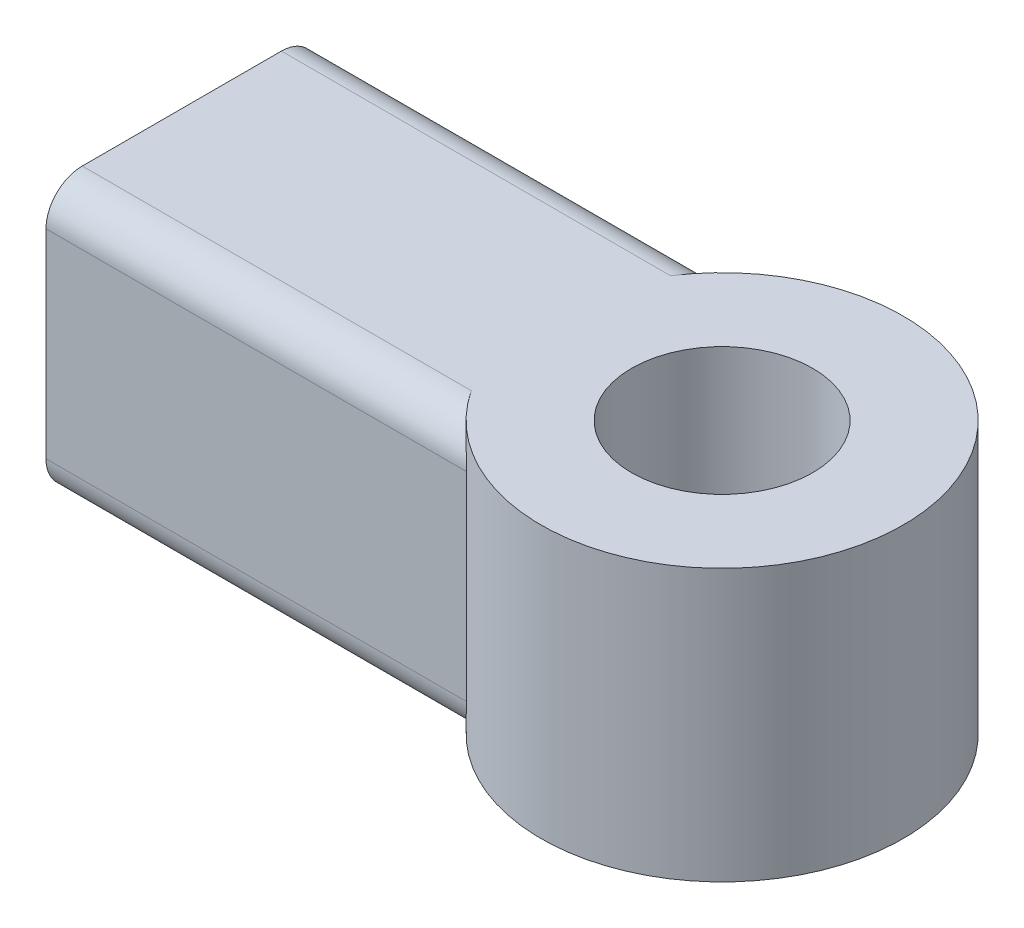
ISO-10303-21;
HEADER;
FILE_DESCRIPTION(('STEP AP214'),'2;1');
FILE_NAME('part.step','',(''),(''),'','','');
FILE_SCHEMA(('AUTOMOTIVE_DESIGN { 1 0 10303 214 1 1 1 1 }'));
ENDSEC;
DATA;
#1=APPLICATION_CONTEXT('core data for automotive mechanical design processes');
#2=APPLICATION_PROTOCOL_DEFINITION('international standard','automotive_design',2000,#1);
#3=PRODUCT_CONTEXT('',#1,'mechanical');
#4=PRODUCT('Part','Part','',(#3));
#5=PRODUCT_RELATED_PRODUCT_CATEGORY('part','',(#4));
#6=PRODUCT_DEFINITION_FORMATION('','',#4);
#7=PRODUCT_DEFINITION_CONTEXT('part definition',#1,'design');
#8=PRODUCT_DEFINITION('design','',#6,#7);
#9=PRODUCT_DEFINITION_SHAPE('','',#8);
#10=(LENGTH_UNIT() NAMED_UNIT(*) SI_UNIT(.MILLI.,.METRE.));
#11=(NAMED_UNIT(*) PLANE_ANGLE_UNIT() SI_UNIT($,.RADIAN.));
#12=(NAMED_UNIT(*) SI_UNIT($,.STERADIAN.) SOLID_ANGLE_UNIT());
#13=UNCERTAINTY_MEASURE_WITH_UNIT(LENGTH_MEASURE(1.E-05),#10,'distance_accuracy_value','');
#14=(GEOMETRIC_REPRESENTATION_CONTEXT(3) GLOBAL_UNCERTAINTY_ASSIGNED_CONTEXT((#13)) GLOBAL_UNIT_ASSIGNED_CONTEXT((#10,
#11,#12)) REPRESENTATION_CONTEXT('',''));
#15=CARTESIAN_POINT('',(0.,0.,0.));
#16=DIRECTION('',(0.,0.,1.));
#17=DIRECTION('',(1.,0.,0.));
#18=AXIS2_PLACEMENT_3D('',#15,#16,#17);
#19=CARTESIAN_POINT('',(0.,9.525,0.));
#20=DIRECTION('',(0.,1.,0.));
#21=DIRECTION('',(0.,0.,1.));
#22=AXIS2_PLACEMENT_3D('',#19,#20,#21);
#23=PLANE('',#22);
#24=CARTESIAN_POINT('',(0.,9.525,0.));
#25=DIRECTION('',(0.,1.,0.));
#26=DIRECTION('',(0.,0.,1.));
#27=AXIS2_PLACEMENT_3D('',#24,#25,#26);
#28=CIRCLE('',#27,6.35);
#29=CARTESIAN_POINT('',(-5.30329555559559,9.525,3.4925));
#30=VERTEX_POINT('',#29);
#31=CARTESIAN_POINT('',(-5.3032955555956,9.525,-3.4925));
#32=VERTEX_POINT('',#31);
#33=EDGE_CURVE('E121',#30,#32,#28,.T.);
#34=ORIENTED_EDGE('',*,*,#33,.T.);
#35=DIRECTION('',(-1.,0.,0.));
#36=VECTOR('',#35,1.);
#37=CARTESIAN_POINT('',(-18.9484589168103,9.525,-3.4925));
#38=LINE('',#37,#36);
#39=CARTESIAN_POINT('',(-18.9484589168103,9.525,-3.49249999999999));
#40=VERTEX_POINT('',#39);
#41=EDGE_CURVE('E106',#32,#40,#38,.T.);
#42=ORIENTED_EDGE('',*,*,#41,.T.);
#43=DIRECTION('',(0.,0.,1.));
#44=VECTOR('',#43,1.);
#45=CARTESIAN_POINT('',(-18.9484589168103,9.525,4.7625));
#46=LINE('',#45,#44);
#47=CARTESIAN_POINT('',(-18.9484589168103,9.525,3.4925));
#48=VERTEX_POINT('',#47);
#49=EDGE_CURVE('E119',#40,#48,#46,.T.);
#50=ORIENTED_EDGE('',*,*,#49,.T.);
#51=DIRECTION('',(1.,0.,0.));
#52=VECTOR('',#51,1.);
#53=CARTESIAN_POINT('',(-4.20013020631504,9.525,3.4925));
#54=LINE('',#53,#52);
#55=EDGE_CURVE('E124',#48,#30,#54,.T.);
#56=ORIENTED_EDGE('',*,*,#55,.T.);
#57=EDGE_LOOP('',(#34,#42,#50,#56));
#58=FACE_BOUND('',#57,.T.);
#59=CARTESIAN_POINT('',(0.,9.525,0.));
#60=DIRECTION('',(0.,1.,0.));
#61=DIRECTION('',(0.,0.,1.));
#62=AXIS2_PLACEMENT_3D('',#59,#60,#61);
#63=CIRCLE('',#62,3.175);
#64=CARTESIAN_POINT('',(0.,9.525,3.175));
#65=VERTEX_POINT('',#64);
#66=EDGE_CURVE('E140',#65,#65,#63,.T.);
#67=ORIENTED_EDGE('',*,*,#66,.F.);
#68=EDGE_LOOP('',(#67));
#69=FACE_BOUND('',#68,.T.);
#70=ADVANCED_FACE('F32',(#58,#69),#23,.T.);
#71=CARTESIAN_POINT('',(0.,0.,0.));
#72=DIRECTION('',(0.,1.,0.));
#73=DIRECTION('',(0.,0.,1.));
#74=AXIS2_PLACEMENT_3D('',#71,#72,#73);
#75=PLANE('',#74);
#76=DIRECTION('',(0.,0.,1.));
#77=VECTOR('',#76,1.);
#78=CARTESIAN_POINT('',(-18.9484589168103,0.,4.7625));
#79=LINE('',#78,#77);
#80=CARTESIAN_POINT('',(-18.9484589168103,0.,-3.49249999999999));
#81=VERTEX_POINT('',#80);
#82=CARTESIAN_POINT('',(-18.9484589168103,0.,3.4925));
#83=VERTEX_POINT('',#82);
#84=EDGE_CURVE('E133',#81,#83,#79,.T.);
#85=ORIENTED_EDGE('',*,*,#84,.F.);
#86=DIRECTION('',(-1.,0.,0.));
#87=VECTOR('',#86,1.);
#88=CARTESIAN_POINT('',(0.,0.,-3.4925));
#89=LINE('',#88,#87);
#90=CARTESIAN_POINT('',(-5.3032955555956,0.,-3.4925));
#91=VERTEX_POINT('',#90);
#92=EDGE_CURVE('E161',#81,#91,#89,.F.);
#93=ORIENTED_EDGE('',*,*,#92,.T.);
#94=CARTESIAN_POINT('',(0.,0.,0.));
#95=DIRECTION('',(0.,1.,0.));
#96=DIRECTION('',(0.,0.,1.));
#97=AXIS2_PLACEMENT_3D('',#94,#95,#96);
#98=CIRCLE('',#97,6.35);
#99=CARTESIAN_POINT('',(-5.30329555559559,0.,3.4925));
#100=VERTEX_POINT('',#99);
#101=EDGE_CURVE('E129',#100,#91,#98,.T.);
#102=ORIENTED_EDGE('',*,*,#101,.F.);
#103=DIRECTION('',(1.,0.,0.));
#104=VECTOR('',#103,1.);
#105=CARTESIAN_POINT('',(0.,0.,3.4925));
#106=LINE('',#105,#104);
#107=EDGE_CURVE('E159',#100,#83,#106,.F.);
#108=ORIENTED_EDGE('',*,*,#107,.T.);
#109=EDGE_LOOP('',(#85,#93,#102,#108));
#110=FACE_BOUND('',#109,.T.);
#111=CARTESIAN_POINT('',(0.,0.,0.));
#112=DIRECTION('',(0.,1.,0.));
#113=DIRECTION('',(0.,0.,1.));
#114=AXIS2_PLACEMENT_3D('',#111,#112,#113);
#115=CIRCLE('',#114,3.175);
#116=CARTESIAN_POINT('',(0.,0.,3.175));
#117=VERTEX_POINT('',#116);
#118=EDGE_CURVE('E136',#117,#117,#115,.T.);
#119=ORIENTED_EDGE('',*,*,#118,.T.);
#120=EDGE_LOOP('',(#119));
#121=FACE_BOUND('',#120,.T.);
#122=ADVANCED_FACE('F206',(#110,#121),#75,.F.);
#123=CARTESIAN_POINT('',(-18.9484589168103,9.525,4.7625));
#124=DIRECTION('',(1.,0.,0.));
#125=DIRECTION('',(0.,0.,-1.));
#126=AXIS2_PLACEMENT_3D('',#123,#124,#125);
#127=PLANE('',#126);
#128=CARTESIAN_POINT('',(-18.9484589168103,4.7625,0.));
#129=DIRECTION('',(-1.,0.,0.));
#130=DIRECTION('',(0.,0.,1.));
#131=AXIS2_PLACEMENT_3D('',#128,#129,#130);
#132=CIRCLE('',#131,3.175);
#133=CARTESIAN_POINT('',(-18.9484589168103,4.7625,3.175));
#134=VERTEX_POINT('',#133);
#135=EDGE_CURVE('E244',#134,#134,#132,.T.);
#136=ORIENTED_EDGE('',*,*,#135,.F.);
#137=EDGE_LOOP('',(#136));
#138=FACE_BOUND('',#137,.T.);
#139=ORIENTED_EDGE('',*,*,#49,.F.);
#140=CARTESIAN_POINT('',(-18.9484589168103,8.255,-3.4925));
#141=DIRECTION('',(1.,0.,0.));
#142=DIRECTION('',(0.,0.,-1.));
#143=AXIS2_PLACEMENT_3D('',#140,#141,#142);
#144=CIRCLE('',#143,1.27);
#145=CARTESIAN_POINT('',(-18.9484589168103,8.255,-4.7625));
#146=VERTEX_POINT('',#145);
#147=EDGE_CURVE('E102',#40,#146,#144,.F.);
#148=ORIENTED_EDGE('',*,*,#147,.T.);
#149=DIRECTION('',(0.,-1.,0.));
#150=VECTOR('',#149,1.);
#151=CARTESIAN_POINT('',(-18.9484589168103,9.525,-4.7625));
#152=LINE('',#151,#150);
#153=CARTESIAN_POINT('',(-18.9484589168103,1.27,-4.7625));
#154=VERTEX_POINT('',#153);
#155=EDGE_CURVE('E131',#146,#154,#152,.T.);
#156=ORIENTED_EDGE('',*,*,#155,.T.);
#157=CARTESIAN_POINT('',(-18.9484589168103,1.27,-3.4925));
#158=DIRECTION('',(1.,0.,0.));
#159=DIRECTION('',(0.,0.,-1.));
#160=AXIS2_PLACEMENT_3D('',#157,#158,#159);
#161=CIRCLE('',#160,1.27);
#162=EDGE_CURVE('E113',#154,#81,#161,.F.);
#163=ORIENTED_EDGE('',*,*,#162,.T.);
#164=ORIENTED_EDGE('',*,*,#84,.T.);
#165=CARTESIAN_POINT('',(-18.9484589168103,1.27,3.4925));
#166=DIRECTION('',(1.,0.,0.));
#167=DIRECTION('',(0.,0.,-1.));
#168=AXIS2_PLACEMENT_3D('',#165,#166,#167);
#169=CIRCLE('',#168,1.27);
#170=CARTESIAN_POINT('',(-18.9484589168103,1.27,4.7625));
#171=VERTEX_POINT('',#170);
#172=EDGE_CURVE('E153',#83,#171,#169,.F.);
#173=ORIENTED_EDGE('',*,*,#172,.T.);
#174=DIRECTION('',(0.,-1.,0.));
#175=VECTOR('',#174,1.);
#176=CARTESIAN_POINT('',(-18.9484589168103,9.525,4.7625));
#177=LINE('',#176,#175);
#178=CARTESIAN_POINT('',(-18.9484589168103,8.255,4.7625));
#179=VERTEX_POINT('',#178);
#180=EDGE_CURVE('E148',#179,#171,#177,.T.);
#181=ORIENTED_EDGE('',*,*,#180,.F.);
#182=CARTESIAN_POINT('',(-18.9484589168103,8.255,3.4925));
#183=DIRECTION('',(1.,0.,0.));
#184=DIRECTION('',(0.,0.,-1.));
#185=AXIS2_PLACEMENT_3D('',#182,#183,#184);
#186=CIRCLE('',#185,1.27);
#187=EDGE_CURVE('E123',#179,#48,#186,.F.);
#188=ORIENTED_EDGE('',*,*,#187,.T.);
#189=EDGE_LOOP('',(#139,#148,#156,#163,#164,#173,#181,#188));
#190=FACE_BOUND('',#189,.T.);
#191=ADVANCED_FACE('F126',(#138,#190),#127,.F.);
#192=CARTESIAN_POINT('',(-4.20013020631503,9.525,4.7625));
#193=DIRECTION('',(0.,0.,-1.));
#194=DIRECTION('',(-1.,0.,0.));
#195=AXIS2_PLACEMENT_3D('',#192,#193,#194);
#196=PLANE('',#195);
#197=ORIENTED_EDGE('',*,*,#180,.T.);
#198=DIRECTION('',(1.,0.,0.));
#199=VECTOR('',#198,1.);
#200=CARTESIAN_POINT('',(-4.20013020631503,1.27,4.7625));
#201=LINE('',#200,#199);
#202=CARTESIAN_POINT('',(-4.20013020631504,1.27,4.7625));
#203=VERTEX_POINT('',#202);
#204=EDGE_CURVE('E166',#171,#203,#201,.T.);
#205=ORIENTED_EDGE('',*,*,#204,.T.);
#206=DIRECTION('',(0.,-1.,0.));
#207=VECTOR('',#206,1.);
#208=CARTESIAN_POINT('',(-4.20013020631504,9.525,4.7625));
#209=LINE('',#208,#207);
#210=CARTESIAN_POINT('',(-4.20013020631504,8.255,4.7625));
#211=VERTEX_POINT('',#210);
#212=EDGE_CURVE('E146',#211,#203,#209,.T.);
#213=ORIENTED_EDGE('',*,*,#212,.F.);
#214=DIRECTION('',(1.,0.,0.));
#215=VECTOR('',#214,1.);
#216=CARTESIAN_POINT('',(-18.9484589168103,8.255,4.7625));
#217=LINE('',#216,#215);
#218=EDGE_CURVE('E164',#211,#179,#217,.F.);
#219=ORIENTED_EDGE('',*,*,#218,.T.);
#220=EDGE_LOOP('',(#197,#205,#213,#219));
#221=FACE_BOUND('',#220,.T.);
#222=ADVANCED_FACE('F209',(#221),#196,.F.);
#223=CARTESIAN_POINT('',(0.,9.525,0.));
#224=DIRECTION('',(0.,-1.,0.));
#225=DIRECTION('',(0.,0.,-1.));
#226=AXIS2_PLACEMENT_3D('',#223,#224,#225);
#227=CYLINDRICAL_SURFACE('',#226,6.35);
#228=ORIENTED_EDGE('',*,*,#101,.T.);
#229=CARTESIAN_POINT('',(-5.3032955555956,0.,-3.4925));
#230=CARTESIAN_POINT('',(-5.27359193249195,6.52779724683472E-06,-3.53761131289388));
#231=CARTESIAN_POINT('',(-5.2433300358599,0.0024031210133934,-3.58230215478618));
#232=CARTESIAN_POINT('',(-5.1819293551872,0.0117600977765963,-3.67055704957392));
#233=CARTESIAN_POINT('',(-5.15079106114589,0.0187179777538209,-3.71412170697569));
#234=CARTESIAN_POINT('',(-5.05631585226645,0.0461294320977427,-3.84284658267326));
#235=CARTESIAN_POINT('',(-4.99197115411557,0.0731200672262755,-3.92595817204894));
#236=CARTESIAN_POINT('',(-4.86437228131976,0.142395193622439,-4.08294297173452));
#237=CARTESIAN_POINT('',(-4.80112524013156,0.184330325758508,-4.15697914307488));
#238=CARTESIAN_POINT('',(-4.67673760869707,0.283140693042977,-4.29642939386015));
#239=CARTESIAN_POINT('',(-4.61559537576438,0.340003964209598,-4.36185031513027));
#240=CARTESIAN_POINT('',(-4.5160873071006,0.45013702328145,-4.46441413598644));
#241=CARTESIAN_POINT('',(-4.47627954829376,0.499617911746981,-4.50423958013182));
#242=CARTESIAN_POINT('',(-4.40151264689171,0.606499536232734,-4.57732448104472));
#243=CARTESIAN_POINT('',(-4.36654563221848,0.663887103653606,-4.61059463631039));
#244=CARTESIAN_POINT('',(-4.31195208159121,0.771315180896804,-4.66161015842651));
#245=CARTESIAN_POINT('',(-4.29067153991794,0.819650077811002,-4.68115951201044));
#246=CARTESIAN_POINT('',(-4.25396408636349,0.92027520778807,-4.71454173992361));
#247=CARTESIAN_POINT('',(-4.23851952498638,0.972552931979171,-4.72839186167922));
#248=CARTESIAN_POINT('',(-4.21810555648332,1.06570230577437,-4.74660173738453));
#249=CARTESIAN_POINT('',(-4.21144161153584,1.10590213629749,-4.75250683528842));
#250=CARTESIAN_POINT('',(-4.20241827555519,1.18737652366358,-4.76048225946277));
#251=CARTESIAN_POINT('',(-4.20008301274044,1.22865581167079,-4.76253109174983));
#252=CARTESIAN_POINT('',(-4.20013020631504,1.27,-4.7625));
#253=B_SPLINE_CURVE_WITH_KNOTS('',3,(#229,#230,#231,#232,#233,#234,#235,#236,#237,#238,#239,
#240,#241,#242,#243,#244,#245,#246,#247,#248,#249,#250,#251,#252),.UNSPECIFIED.,.F.,.F.,(4,2,2,
2,2,2,2,2,2,2,2,4),(0.,0.161902356459137,0.323715923309768,0.647625221059924,0.964411839025793,
1.28094534304759,1.50516008717384,1.72900581624811,1.89735775626463,2.0651964026532,
2.18831975579654,2.31212736244025),.UNSPECIFIED.);
#254=CARTESIAN_POINT('',(-4.20013020631504,1.27,-4.7625));
#255=VERTEX_POINT('',#254);
#256=EDGE_CURVE('E174',#91,#255,#253,.T.);
#257=ORIENTED_EDGE('',*,*,#256,.T.);
#258=DIRECTION('',(0.,-1.,0.));
#259=VECTOR('',#258,1.);
#260=CARTESIAN_POINT('',(-4.20013020631504,9.525,-4.7625));
#261=LINE('',#260,#259);
#262=CARTESIAN_POINT('',(-4.20013020631504,8.255,-4.7625));
#263=VERTEX_POINT('',#262);
#264=EDGE_CURVE('E143',#263,#255,#261,.T.);
#265=ORIENTED_EDGE('',*,*,#264,.F.);
#266=CARTESIAN_POINT('',(-4.20013020631504,8.255,-4.7625));
#267=CARTESIAN_POINT('',(-4.20012211862867,8.28319785483389,-4.76250498307731));
#268=CARTESIAN_POINT('',(-4.20119609372336,8.31137550999857,-4.76156012317124));
#269=CARTESIAN_POINT('',(-4.20542639442946,8.36741626064644,-4.75782527470246));
#270=CARTESIAN_POINT('',(-4.20858010520386,8.39527970649762,-4.75503760308325));
#271=CARTESIAN_POINT('',(-4.22094136740364,8.47742174750408,-4.74407816756563));
#272=CARTESIAN_POINT('',(-4.23305335706444,8.53095026530805,-4.73330697693976));
#273=CARTESIAN_POINT('',(-4.26364497116893,8.63412288476029,-4.70576700420154));
#274=CARTESIAN_POINT('',(-4.28209497104659,8.68378376244424,-4.68902611153109));
#275=CARTESIAN_POINT('',(-4.32391883699333,8.77903452804365,-4.6504881350644));
#276=CARTESIAN_POINT('',(-4.34730854948043,8.82461062527084,-4.62867475558511));
#277=CARTESIAN_POINT('',(-4.41097211549499,8.93431702661454,-4.56821817893938));
#278=CARTESIAN_POINT('',(-4.45363393105488,8.99551468053802,-4.52677497333755));
#279=CARTESIAN_POINT('',(-4.54380261922865,9.10789263270936,-4.43626779441584));
#280=CARTESIAN_POINT('',(-4.59132039037033,9.1590496103288,-4.38718654360686));
#281=CARTESIAN_POINT('',(-4.70235483894877,9.26441415323173,-4.26833064544724));
#282=CARTESIAN_POINT('',(-4.76666682285152,9.31556507801929,-4.19658385814883));
#283=CARTESIAN_POINT('',(-4.89606437594231,9.40190269267573,-4.0448738860203));
#284=CARTESIAN_POINT('',(-4.96114913889675,9.43710473748004,-3.96491869528944));
#285=CARTESIAN_POINT('',(-5.07319841721331,9.48380368403804,-3.81984915855057));
#286=CARTESIAN_POINT('',(-5.12051749977457,9.49906904474297,-3.75620775802863));
#287=CARTESIAN_POINT('',(-5.2134114910215,9.51964952603686,-3.62619777614188));
#288=CARTESIAN_POINT('',(-5.25898775831201,9.52497255868023,-3.55983140631784));
#289=CARTESIAN_POINT('',(-5.3032955555956,9.525,-3.49249999999999));
#290=B_SPLINE_CURVE_WITH_KNOTS('',3,(#266,#267,#268,#269,#270,#271,#272,#273,#274,#275,#276,
#277,#278,#279,#280,#281,#282,#283,#284,#285,#286,#287,#288,#289),.UNSPECIFIED.,.F.,.F.,(4,2,2,
2,2,2,2,2,2,2,2,4),(0.,0.0845201171612266,0.168934169861919,0.335703775929661,0.50170425586777,
0.668245575759364,0.92285223928473,1.17804343444812,1.50368430417439,1.82901099035876,
2.07065340989457,2.31210344954862),.UNSPECIFIED.);
#291=EDGE_CURVE('E168',#263,#32,#290,.T.);
#292=ORIENTED_EDGE('',*,*,#291,.T.);
#293=ORIENTED_EDGE('',*,*,#33,.F.);
#294=CARTESIAN_POINT('',(-5.30329555559559,9.525,3.4925));
#295=CARTESIAN_POINT('',(-5.27359193249195,9.52499347220275,3.53761131289389));
#296=CARTESIAN_POINT('',(-5.24333003585989,9.5225968789866,3.58230215478619));
#297=CARTESIAN_POINT('',(-5.18192935518719,9.5132399022234,3.67055704957393));
#298=CARTESIAN_POINT('',(-5.15079106114589,9.50628202224618,3.7141217069757));
#299=CARTESIAN_POINT('',(-5.05631585226644,9.47887056790226,3.84284658267327));
#300=CARTESIAN_POINT('',(-4.99197115411557,9.45187993277373,3.92595817204895));
#301=CARTESIAN_POINT('',(-4.86437228131976,9.38260480637756,4.08294297173453));
#302=CARTESIAN_POINT('',(-4.80112524013155,9.34066967424149,4.15697914307488));
#303=CARTESIAN_POINT('',(-4.67673760869707,9.24185930695702,4.29642939386015));
#304=CARTESIAN_POINT('',(-4.61559537576437,9.18499603579041,4.36185031513028));
#305=CARTESIAN_POINT('',(-4.51608730710059,9.07486297671855,4.46441413598645));
#306=CARTESIAN_POINT('',(-4.47627954829376,9.02538208825302,4.50423958013183));
#307=CARTESIAN_POINT('',(-4.4015126468917,8.91850046376726,4.57732448104472));
#308=CARTESIAN_POINT('',(-4.36654563221847,8.86111289634639,4.6105946363104));
#309=CARTESIAN_POINT('',(-4.3119520815912,8.7536848191032,4.66161015842652));
#310=CARTESIAN_POINT('',(-4.29067153991793,8.705349922189,4.68115951201045));
#311=CARTESIAN_POINT('',(-4.25396408636348,8.60472479221193,4.71454173992362));
#312=CARTESIAN_POINT('',(-4.23851952498637,8.55244706802083,4.72839186167923));
#313=CARTESIAN_POINT('',(-4.21810555648331,8.45929769422563,4.74660173738454));
#314=CARTESIAN_POINT('',(-4.21144161153584,8.41909786370251,4.75250683528843));
#315=CARTESIAN_POINT('',(-4.20241827555519,8.33762347633641,4.76048225946278));
#316=CARTESIAN_POINT('',(-4.20008301274044,8.29634418832921,4.76253109174983));
#317=CARTESIAN_POINT('',(-4.20013020631503,8.255,4.7625));
#318=B_SPLINE_CURVE_WITH_KNOTS('',3,(#294,#295,#296,#297,#298,#299,#300,#301,#302,#303,#304,
#305,#306,#307,#308,#309,#310,#311,#312,#313,#314,#315,#316,#317),.UNSPECIFIED.,.F.,.F.,(4,2,2,
2,2,2,2,2,2,2,2,4),(0.,0.161902356459137,0.323715923309767,0.647625221059924,0.964411839025793,
1.28094534304759,1.50516008717384,1.72900581624812,1.89735775626464,2.0651964026532,
2.18831975579655,2.31212736244025),.UNSPECIFIED.);
#319=EDGE_CURVE('E11',#30,#211,#318,.T.);
#320=ORIENTED_EDGE('',*,*,#319,.T.);
#321=ORIENTED_EDGE('',*,*,#212,.T.);
#322=CARTESIAN_POINT('',(-4.20013020631504,1.27,4.7625));
#323=CARTESIAN_POINT('',(-4.20012211862867,1.24180214516611,4.76250498307732));
#324=CARTESIAN_POINT('',(-4.20119609372335,1.21362449000143,4.76156012317125));
#325=CARTESIAN_POINT('',(-4.20542639442945,1.15758373935356,4.75782527470247));
#326=CARTESIAN_POINT('',(-4.20858010520385,1.12972029350238,4.75503760308326));
#327=CARTESIAN_POINT('',(-4.22094136740364,1.04757825249592,4.74407816756563));
#328=CARTESIAN_POINT('',(-4.23305335706443,0.994049734691952,4.73330697693976));
#329=CARTESIAN_POINT('',(-4.26364497116893,0.890877115239714,4.70576700420155));
#330=CARTESIAN_POINT('',(-4.28209497104658,0.841216237555765,4.6890261115311));
#331=CARTESIAN_POINT('',(-4.32391883699333,0.745965471956347,4.65048813506441));
#332=CARTESIAN_POINT('',(-4.34730854948042,0.700389374729162,4.62867475558512));
#333=CARTESIAN_POINT('',(-4.41097211549498,0.590682973385458,4.56821817893938));
#334=CARTESIAN_POINT('',(-4.45363393105487,0.529485319461981,4.52677497333756));
#335=CARTESIAN_POINT('',(-4.54380261922864,0.417107367290639,4.43626779441585));
#336=CARTESIAN_POINT('',(-4.59132039037033,0.365950389671198,4.38718654360686));
#337=CARTESIAN_POINT('',(-4.70235483894877,0.26058584676827,4.26833064544725));
#338=CARTESIAN_POINT('',(-4.76666682285152,0.209434921980713,4.19658385814883));
#339=CARTESIAN_POINT('',(-4.89606437594231,0.12309730732427,4.04487388602031));
#340=CARTESIAN_POINT('',(-4.96114913889674,0.0878952625199641,3.96491869528944));
#341=CARTESIAN_POINT('',(-5.07319841721331,0.0411963159619564,3.81984915855057));
#342=CARTESIAN_POINT('',(-5.12051749977457,0.0259309552570268,3.75620775802864));
#343=CARTESIAN_POINT('',(-5.2134114910215,0.00535047396313926,3.62619777614189));
#344=CARTESIAN_POINT('',(-5.25898775831201,2.74413197752903E-05,3.55983140631785));
#345=CARTESIAN_POINT('',(-5.30329555559559,0.,3.4925));
#346=B_SPLINE_CURVE_WITH_KNOTS('',3,(#322,#323,#324,#325,#326,#327,#328,#329,#330,#331,#332,
#333,#334,#335,#336,#337,#338,#339,#340,#341,#342,#343,#344,#345),.UNSPECIFIED.,.F.,.F.,(4,2,2,
2,2,2,2,2,2,2,2,4),(0.,0.0845201171612263,0.168934169861919,0.335703775929661,0.50170425586777,
0.668245575759363,0.922852239284729,1.17804343444812,1.50368430417439,1.82901099035876,
2.07065340989457,2.31210344954862),.UNSPECIFIED.);
#347=EDGE_CURVE('E45',#203,#100,#346,.T.);
#348=ORIENTED_EDGE('',*,*,#347,.T.);
#349=EDGE_LOOP('',(#228,#257,#265,#292,#293,#320,#321,#348));
#350=FACE_BOUND('',#349,.T.);
#351=ADVANCED_FACE('F179',(#350),#227,.T.);
#352=CARTESIAN_POINT('',(-4.20013020631504,9.525,-4.7625));
#353=DIRECTION('',(0.,0.,1.));
#354=DIRECTION('',(1.,0.,0.));
#355=AXIS2_PLACEMENT_3D('',#352,#353,#354);
#356=PLANE('',#355);
#357=ORIENTED_EDGE('',*,*,#155,.F.);
#358=DIRECTION('',(-1.,0.,0.));
#359=VECTOR('',#358,1.);
#360=CARTESIAN_POINT('',(-4.20013020631504,8.255,-4.7625));
#361=LINE('',#360,#359);
#362=EDGE_CURVE('E107',#146,#263,#361,.F.);
#363=ORIENTED_EDGE('',*,*,#362,.T.);
#364=ORIENTED_EDGE('',*,*,#264,.T.);
#365=DIRECTION('',(-1.,0.,0.));
#366=VECTOR('',#365,1.);
#367=CARTESIAN_POINT('',(-4.20013020631504,1.27,-4.7625));
#368=LINE('',#367,#366);
#369=EDGE_CURVE('E112',#255,#154,#368,.T.);
#370=ORIENTED_EDGE('',*,*,#369,.T.);
#371=EDGE_LOOP('',(#357,#363,#364,#370));
#372=FACE_BOUND('',#371,.T.);
#373=ADVANCED_FACE('F202',(#372),#356,.F.);
#374=CARTESIAN_POINT('',(0.,9.525,0.));
#375=DIRECTION('',(0.,-1.,0.));
#376=DIRECTION('',(0.,0.,-1.));
#377=AXIS2_PLACEMENT_3D('',#374,#375,#376);
#378=CYLINDRICAL_SURFACE('',#377,3.175);
#379=ORIENTED_EDGE('',*,*,#66,.T.);
#380=EDGE_LOOP('',(#379));
#381=FACE_BOUND('',#380,.T.);
#382=ORIENTED_EDGE('',*,*,#118,.F.);
#383=EDGE_LOOP('',(#382));
#384=FACE_BOUND('',#383,.T.);
#385=ADVANCED_FACE('F187',(#381,#384),#378,.F.);
#386=CARTESIAN_POINT('',(0.,8.255,-3.4925));
#387=DIRECTION('',(1.,0.,0.));
#388=DIRECTION('',(0.,0.,-1.));
#389=AXIS2_PLACEMENT_3D('',#386,#387,#388);
#390=CYLINDRICAL_SURFACE('',#389,1.27);
#391=ORIENTED_EDGE('',*,*,#291,.F.);
#392=ORIENTED_EDGE('',*,*,#362,.F.);
#393=ORIENTED_EDGE('',*,*,#147,.F.);
#394=ORIENTED_EDGE('',*,*,#41,.F.);
#395=EDGE_LOOP('',(#391,#392,#393,#394));
#396=FACE_BOUND('',#395,.T.);
#397=ADVANCED_FACE('F105',(#396),#390,.T.);
#398=CARTESIAN_POINT('',(-4.20013020631504,1.27,-3.4925));
#399=DIRECTION('',(-1.,0.,0.));
#400=DIRECTION('',(0.,0.,1.));
#401=AXIS2_PLACEMENT_3D('',#398,#399,#400);
#402=CYLINDRICAL_SURFACE('',#401,1.27);
#403=ORIENTED_EDGE('',*,*,#256,.F.);
#404=ORIENTED_EDGE('',*,*,#92,.F.);
#405=ORIENTED_EDGE('',*,*,#162,.F.);
#406=ORIENTED_EDGE('',*,*,#369,.F.);
#407=EDGE_LOOP('',(#403,#404,#405,#406));
#408=FACE_BOUND('',#407,.T.);
#409=ADVANCED_FACE('F186',(#408),#402,.T.);
#410=CARTESIAN_POINT('',(-4.20013020631503,1.27,3.4925));
#411=DIRECTION('',(1.,0.,0.));
#412=DIRECTION('',(0.,0.,-1.));
#413=AXIS2_PLACEMENT_3D('',#410,#411,#412);
#414=CYLINDRICAL_SURFACE('',#413,1.27);
#415=ORIENTED_EDGE('',*,*,#172,.F.);
#416=ORIENTED_EDGE('',*,*,#107,.F.);
#417=ORIENTED_EDGE('',*,*,#347,.F.);
#418=ORIENTED_EDGE('',*,*,#204,.F.);
#419=EDGE_LOOP('',(#415,#416,#417,#418));
#420=FACE_BOUND('',#419,.T.);
#421=ADVANCED_FACE('F190',(#420),#414,.T.);
#422=CARTESIAN_POINT('',(0.,8.255,3.4925));
#423=DIRECTION('',(-1.,0.,0.));
#424=DIRECTION('',(0.,0.,1.));
#425=AXIS2_PLACEMENT_3D('',#422,#423,#424);
#426=CYLINDRICAL_SURFACE('',#425,1.27);
#427=ORIENTED_EDGE('',*,*,#187,.F.);
#428=ORIENTED_EDGE('',*,*,#218,.F.);
#429=ORIENTED_EDGE('',*,*,#319,.F.);
#430=ORIENTED_EDGE('',*,*,#55,.F.);
#431=EDGE_LOOP('',(#427,#428,#429,#430));
#432=FACE_BOUND('',#431,.T.);
#433=ADVANCED_FACE('F34',(#432),#426,.T.);
#434=CARTESIAN_POINT('',(-6.24845891681029,4.7625,0.));
#435=DIRECTION('',(-1.,0.,0.));
#436=DIRECTION('',(0.,0.,1.));
#437=AXIS2_PLACEMENT_3D('',#434,#435,#436);
#438=CYLINDRICAL_SURFACE('',#437,3.175);
#439=CARTESIAN_POINT('',(-6.24845891681029,4.7625,0.));
#440=DIRECTION('',(-1.,0.,0.));
#441=DIRECTION('',(0.,0.,1.));
#442=AXIS2_PLACEMENT_3D('',#439,#440,#441);
#443=CIRCLE('',#442,3.175);
#444=CARTESIAN_POINT('',(-6.24845891681029,4.7625,3.175));
#445=VERTEX_POINT('',#444);
#446=EDGE_CURVE('E246',#445,#445,#443,.T.);
#447=ORIENTED_EDGE('',*,*,#446,.F.);
#448=EDGE_LOOP('',(#447));
#449=FACE_BOUND('',#448,.T.);
#450=ORIENTED_EDGE('',*,*,#135,.T.);
#451=EDGE_LOOP('',(#450));
#452=FACE_BOUND('',#451,.T.);
#453=ADVANCED_FACE('F213',(#449,#452),#438,.F.);
#454=CARTESIAN_POINT('',(-6.24845891681029,4.7625,0.));
#455=DIRECTION('',(-1.,0.,0.));
#456=DIRECTION('',(0.,0.,1.));
#457=AXIS2_PLACEMENT_3D('',#454,#455,#456);
#458=PLANE('',#457);
#459=ORIENTED_EDGE('',*,*,#446,.T.);
#460=EDGE_LOOP('',(#459));
#461=FACE_BOUND('',#460,.T.);
#462=ADVANCED_FACE('F217',(#461),#458,.T.);
#463=CLOSED_SHELL('',(#70,#122,#191,#222,#351,#373,#385,#397,#409,#421,#433,#453,#462));
#464=MANIFOLD_SOLID_BREP('B2',#463);
#465=ADVANCED_BREP_SHAPE_REPRESENTATION('',(#18,#464),#14);
#466=SHAPE_DEFINITION_REPRESENTATION(#9,#465);
ENDSEC;
END-ISO-10303-21;
